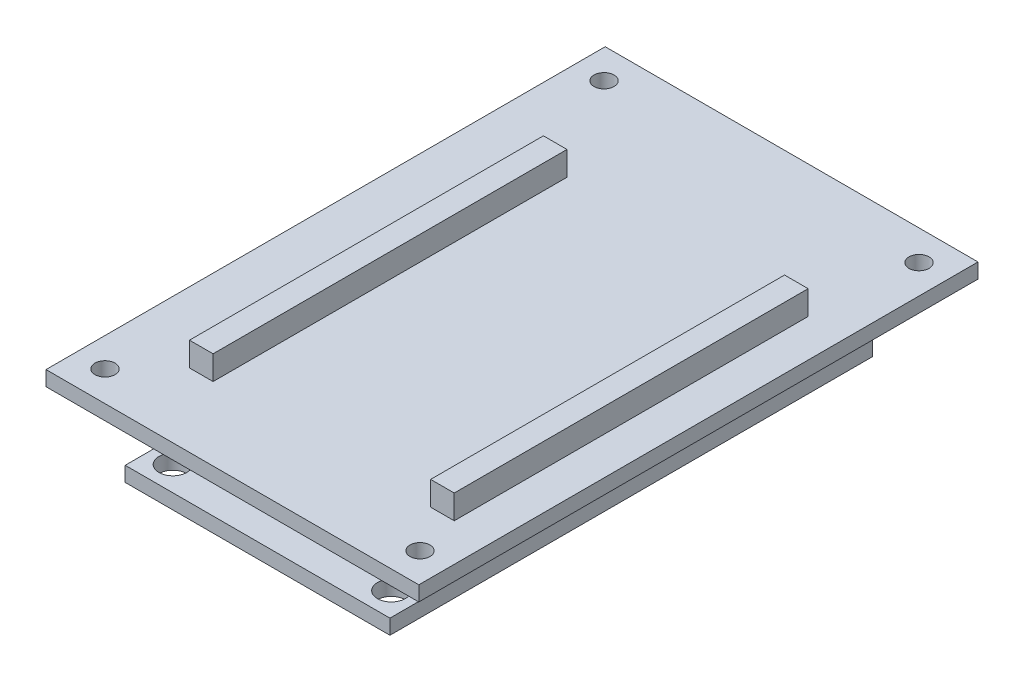
ISO-10303-21;
HEADER;
FILE_DESCRIPTION(('STEP AP214'),'2;1');
FILE_NAME('part.step','',(''),(''),'','','');
FILE_SCHEMA(('AUTOMOTIVE_DESIGN { 1 0 10303 214 1 1 1 1 }'));
ENDSEC;
DATA;
#1=APPLICATION_CONTEXT('core data for automotive mechanical design processes');
#2=APPLICATION_PROTOCOL_DEFINITION('international standard','automotive_design',2000,#1);
#3=PRODUCT_CONTEXT('',#1,'mechanical');
#4=PRODUCT('Part','Part','',(#3));
#5=PRODUCT_RELATED_PRODUCT_CATEGORY('part','',(#4));
#6=PRODUCT_DEFINITION_FORMATION('','',#4);
#7=PRODUCT_DEFINITION_CONTEXT('part definition',#1,'design');
#8=PRODUCT_DEFINITION('design','',#6,#7);
#9=PRODUCT_DEFINITION_SHAPE('','',#8);
#10=(LENGTH_UNIT() NAMED_UNIT(*) SI_UNIT(.MILLI.,.METRE.));
#11=(NAMED_UNIT(*) PLANE_ANGLE_UNIT() SI_UNIT($,.RADIAN.));
#12=(NAMED_UNIT(*) SI_UNIT($,.STERADIAN.) SOLID_ANGLE_UNIT());
#13=UNCERTAINTY_MEASURE_WITH_UNIT(LENGTH_MEASURE(1.E-05),#10,'distance_accuracy_value','');
#14=(GEOMETRIC_REPRESENTATION_CONTEXT(3) GLOBAL_UNCERTAINTY_ASSIGNED_CONTEXT((#13)) GLOBAL_UNIT_ASSIGNED_CONTEXT((#10,
#11,#12)) REPRESENTATION_CONTEXT('',''));
#15=CARTESIAN_POINT('',(0.,0.,0.));
#16=DIRECTION('',(0.,0.,1.));
#17=DIRECTION('',(1.,0.,0.));
#18=AXIS2_PLACEMENT_3D('',#15,#16,#17);
#19=CARTESIAN_POINT('',(-14.2494,1.6002,-25.9715));
#20=DIRECTION('',(1.,0.,0.));
#21=DIRECTION('',(0.,0.,-1.));
#22=AXIS2_PLACEMENT_3D('',#19,#20,#21);
#23=PLANE('',#22);
#24=DIRECTION('',(0.,0.,1.));
#25=VECTOR('',#24,1.);
#26=CARTESIAN_POINT('',(-14.2494,5.6134,-25.9715));
#27=LINE('',#26,#25);
#28=CARTESIAN_POINT('',(-14.2494,5.6134,-19.05));
#29=VERTEX_POINT('',#28);
#30=CARTESIAN_POINT('',(-14.2494,5.6134,19.05));
#31=VERTEX_POINT('',#30);
#32=EDGE_CURVE('E287',#29,#31,#27,.T.);
#33=ORIENTED_EDGE('',*,*,#32,.F.);
#34=DIRECTION('',(0.,-1.,0.));
#35=VECTOR('',#34,1.);
#36=CARTESIAN_POINT('',(-14.2494,9.8044,-19.05));
#37=LINE('',#36,#35);
#38=CARTESIAN_POINT('',(-14.2494,1.6002,-19.05));
#39=VERTEX_POINT('',#38);
#40=EDGE_CURVE('E427',#29,#39,#37,.T.);
#41=ORIENTED_EDGE('',*,*,#40,.T.);
#42=DIRECTION('',(0.,0.,1.));
#43=VECTOR('',#42,1.);
#44=CARTESIAN_POINT('',(-14.2494,1.6002,-25.9715));
#45=LINE('',#44,#43);
#46=CARTESIAN_POINT('',(-14.2494,1.6002,-25.9715));
#47=VERTEX_POINT('',#46);
#48=EDGE_CURVE('E490',#47,#39,#45,.T.);
#49=ORIENTED_EDGE('',*,*,#48,.F.);
#50=DIRECTION('',(0.,-1.,0.));
#51=VECTOR('',#50,1.);
#52=CARTESIAN_POINT('',(-14.2494,1.6002,-25.9715));
#53=LINE('',#52,#51);
#54=CARTESIAN_POINT('',(-14.2494,0.,-25.9715));
#55=VERTEX_POINT('',#54);
#56=EDGE_CURVE('E506',#47,#55,#53,.T.);
#57=ORIENTED_EDGE('',*,*,#56,.T.);
#58=DIRECTION('',(0.,0.,1.));
#59=VECTOR('',#58,1.);
#60=CARTESIAN_POINT('',(-14.2494,0.,-25.9715));
#61=LINE('',#60,#59);
#62=CARTESIAN_POINT('',(-14.2494,0.,25.9715));
#63=VERTEX_POINT('',#62);
#64=EDGE_CURVE('E486',#55,#63,#61,.T.);
#65=ORIENTED_EDGE('',*,*,#64,.T.);
#66=DIRECTION('',(0.,-1.,0.));
#67=VECTOR('',#66,1.);
#68=CARTESIAN_POINT('',(-14.2494,1.6002,25.9715));
#69=LINE('',#68,#67);
#70=CARTESIAN_POINT('',(-14.2494,1.6002,25.9715));
#71=VERTEX_POINT('',#70);
#72=EDGE_CURVE('E530',#71,#63,#69,.T.);
#73=ORIENTED_EDGE('',*,*,#72,.F.);
#74=CARTESIAN_POINT('',(-14.2494,1.6002,19.05));
#75=VERTEX_POINT('',#74);
#76=EDGE_CURVE('E495',#75,#71,#45,.T.);
#77=ORIENTED_EDGE('',*,*,#76,.F.);
#78=DIRECTION('',(0.,-1.,0.));
#79=VECTOR('',#78,1.);
#80=CARTESIAN_POINT('',(-14.2494,9.8044,19.05));
#81=LINE('',#80,#79);
#82=EDGE_CURVE('E452',#31,#75,#81,.T.);
#83=ORIENTED_EDGE('',*,*,#82,.F.);
#84=EDGE_LOOP('',(#33,#41,#49,#57,#65,#73,#77,#83));
#85=FACE_BOUND('',#84,.T.);
#86=ADVANCED_FACE('F45',(#85),#23,.F.);
#87=CARTESIAN_POINT('',(14.2494,1.6002,-25.9715));
#88=DIRECTION('',(-1.,0.,0.));
#89=DIRECTION('',(0.,0.,1.));
#90=AXIS2_PLACEMENT_3D('',#87,#88,#89);
#91=PLANE('',#90);
#92=DIRECTION('',(0.,0.,-1.));
#93=VECTOR('',#92,1.);
#94=CARTESIAN_POINT('',(14.2494,5.6134,-25.9715));
#95=LINE('',#94,#93);
#96=CARTESIAN_POINT('',(14.2494,5.6134,19.05));
#97=VERTEX_POINT('',#96);
#98=CARTESIAN_POINT('',(14.2494,5.6134,-19.05));
#99=VERTEX_POINT('',#98);
#100=EDGE_CURVE('E275',#97,#99,#95,.T.);
#101=ORIENTED_EDGE('',*,*,#100,.F.);
#102=DIRECTION('',(0.,-1.,0.));
#103=VECTOR('',#102,1.);
#104=CARTESIAN_POINT('',(14.2494,9.8044,19.05));
#105=LINE('',#104,#103);
#106=CARTESIAN_POINT('',(14.2494,1.6002,19.05));
#107=VERTEX_POINT('',#106);
#108=EDGE_CURVE('E382',#97,#107,#105,.T.);
#109=ORIENTED_EDGE('',*,*,#108,.T.);
#110=DIRECTION('',(0.,0.,-1.));
#111=VECTOR('',#110,1.);
#112=CARTESIAN_POINT('',(14.2494,1.6002,-25.9715));
#113=LINE('',#112,#111);
#114=CARTESIAN_POINT('',(14.2494,1.6002,25.9715));
#115=VERTEX_POINT('',#114);
#116=EDGE_CURVE('E499',#115,#107,#113,.T.);
#117=ORIENTED_EDGE('',*,*,#116,.F.);
#118=DIRECTION('',(0.,-1.,0.));
#119=VECTOR('',#118,1.);
#120=CARTESIAN_POINT('',(14.2494,1.6002,25.9715));
#121=LINE('',#120,#119);
#122=CARTESIAN_POINT('',(14.2494,0.,25.9715));
#123=VERTEX_POINT('',#122);
#124=EDGE_CURVE('E526',#115,#123,#121,.T.);
#125=ORIENTED_EDGE('',*,*,#124,.T.);
#126=DIRECTION('',(0.,0.,-1.));
#127=VECTOR('',#126,1.);
#128=CARTESIAN_POINT('',(14.2494,0.,-25.9715));
#129=LINE('',#128,#127);
#130=CARTESIAN_POINT('',(14.2494,0.,-25.9715));
#131=VERTEX_POINT('',#130);
#132=EDGE_CURVE('E513',#123,#131,#129,.T.);
#133=ORIENTED_EDGE('',*,*,#132,.T.);
#134=DIRECTION('',(0.,-1.,0.));
#135=VECTOR('',#134,1.);
#136=CARTESIAN_POINT('',(14.2494,1.6002,-25.9715));
#137=LINE('',#136,#135);
#138=CARTESIAN_POINT('',(14.2494,1.6002,-25.9715));
#139=VERTEX_POINT('',#138);
#140=EDGE_CURVE('E522',#139,#131,#137,.T.);
#141=ORIENTED_EDGE('',*,*,#140,.F.);
#142=CARTESIAN_POINT('',(14.2494,1.6002,-19.05));
#143=VERTEX_POINT('',#142);
#144=EDGE_CURVE('E498',#143,#139,#113,.T.);
#145=ORIENTED_EDGE('',*,*,#144,.F.);
#146=DIRECTION('',(0.,-1.,0.));
#147=VECTOR('',#146,1.);
#148=CARTESIAN_POINT('',(14.2494,9.8044,-19.05));
#149=LINE('',#148,#147);
#150=EDGE_CURVE('E407',#99,#143,#149,.T.);
#151=ORIENTED_EDGE('',*,*,#150,.F.);
#152=EDGE_LOOP('',(#101,#109,#117,#125,#133,#141,#145,#151));
#153=FACE_BOUND('',#152,.T.);
#154=ADVANCED_FACE('F552',(#153),#91,.F.);
#155=CARTESIAN_POINT('',(-14.2494,9.8044,19.05));
#156=DIRECTION('',(0.,0.,-1.));
#157=DIRECTION('',(-1.,0.,0.));
#158=AXIS2_PLACEMENT_3D('',#155,#156,#157);
#159=PLANE('',#158);
#160=DIRECTION('',(1.,0.,0.));
#161=VECTOR('',#160,1.);
#162=CARTESIAN_POINT('',(-14.2494,5.6134,19.05));
#163=LINE('',#162,#161);
#164=CARTESIAN_POINT('',(-11.7094,5.6134,19.05));
#165=VERTEX_POINT('',#164);
#166=EDGE_CURVE('E61',#31,#165,#163,.T.);
#167=ORIENTED_EDGE('',*,*,#166,.F.);
#168=ORIENTED_EDGE('',*,*,#82,.T.);
#169=DIRECTION('',(1.,0.,0.));
#170=VECTOR('',#169,1.);
#171=CARTESIAN_POINT('',(-14.2494,1.6002,19.05));
#172=LINE('',#171,#170);
#173=CARTESIAN_POINT('',(-11.7094,1.6002,19.05));
#174=VERTEX_POINT('',#173);
#175=EDGE_CURVE('E412',#75,#174,#172,.T.);
#176=ORIENTED_EDGE('',*,*,#175,.T.);
#177=DIRECTION('',(0.,-1.,0.));
#178=VECTOR('',#177,1.);
#179=CARTESIAN_POINT('',(-11.7094,9.8044,19.05));
#180=LINE('',#179,#178);
#181=EDGE_CURVE('E447',#165,#174,#180,.T.);
#182=ORIENTED_EDGE('',*,*,#181,.F.);
#183=EDGE_LOOP('',(#167,#168,#176,#182));
#184=FACE_BOUND('',#183,.T.);
#185=ADVANCED_FACE('F593',(#184),#159,.F.);
#186=CARTESIAN_POINT('',(-11.7094,9.8044,19.05));
#187=DIRECTION('',(-1.,0.,0.));
#188=DIRECTION('',(0.,0.,1.));
#189=AXIS2_PLACEMENT_3D('',#186,#187,#188);
#190=PLANE('',#189);
#191=DIRECTION('',(0.,0.,-1.));
#192=VECTOR('',#191,1.);
#193=CARTESIAN_POINT('',(-11.7094,5.6134,19.05));
#194=LINE('',#193,#192);
#195=CARTESIAN_POINT('',(-11.7094,5.6134,-19.05));
#196=VERTEX_POINT('',#195);
#197=EDGE_CURVE('E69',#165,#196,#194,.T.);
#198=ORIENTED_EDGE('',*,*,#197,.F.);
#199=ORIENTED_EDGE('',*,*,#181,.T.);
#200=DIRECTION('',(0.,0.,-1.));
#201=VECTOR('',#200,1.);
#202=CARTESIAN_POINT('',(-11.7094,1.6002,19.05));
#203=LINE('',#202,#201);
#204=CARTESIAN_POINT('',(-11.7094,1.6002,-19.05));
#205=VERTEX_POINT('',#204);
#206=EDGE_CURVE('E431',#174,#205,#203,.T.);
#207=ORIENTED_EDGE('',*,*,#206,.T.);
#208=DIRECTION('',(0.,-1.,0.));
#209=VECTOR('',#208,1.);
#210=CARTESIAN_POINT('',(-11.7094,9.8044,-19.05));
#211=LINE('',#210,#209);
#212=EDGE_CURVE('E442',#196,#205,#211,.T.);
#213=ORIENTED_EDGE('',*,*,#212,.F.);
#214=EDGE_LOOP('',(#198,#199,#207,#213));
#215=FACE_BOUND('',#214,.T.);
#216=ADVANCED_FACE('F592',(#215),#190,.F.);
#217=CARTESIAN_POINT('',(-14.2494,9.8044,-19.05));
#218=DIRECTION('',(0.,0.,1.));
#219=DIRECTION('',(1.,0.,0.));
#220=AXIS2_PLACEMENT_3D('',#217,#218,#219);
#221=PLANE('',#220);
#222=DIRECTION('',(-1.,0.,0.));
#223=VECTOR('',#222,1.);
#224=CARTESIAN_POINT('',(-14.2494,5.6134,-19.05));
#225=LINE('',#224,#223);
#226=EDGE_CURVE('E279',#196,#29,#225,.T.);
#227=ORIENTED_EDGE('',*,*,#226,.F.);
#228=ORIENTED_EDGE('',*,*,#212,.T.);
#229=DIRECTION('',(-1.,0.,0.));
#230=VECTOR('',#229,1.);
#231=CARTESIAN_POINT('',(-14.2494,1.6002,-19.05));
#232=LINE('',#231,#230);
#233=EDGE_CURVE('E418',#205,#39,#232,.T.);
#234=ORIENTED_EDGE('',*,*,#233,.T.);
#235=ORIENTED_EDGE('',*,*,#40,.F.);
#236=EDGE_LOOP('',(#227,#228,#234,#235));
#237=FACE_BOUND('',#236,.T.);
#238=ADVANCED_FACE('F580',(#237),#221,.F.);
#239=CARTESIAN_POINT('',(14.2494,9.8044,-19.05));
#240=DIRECTION('',(0.,0.,1.));
#241=DIRECTION('',(1.,0.,0.));
#242=AXIS2_PLACEMENT_3D('',#239,#240,#241);
#243=PLANE('',#242);
#244=DIRECTION('',(-1.,0.,0.));
#245=VECTOR('',#244,1.);
#246=CARTESIAN_POINT('',(14.2494,5.6134,-19.05));
#247=LINE('',#246,#245);
#248=CARTESIAN_POINT('',(11.7094,5.6134,-19.05));
#249=VERTEX_POINT('',#248);
#250=EDGE_CURVE('E266',#99,#249,#247,.T.);
#251=ORIENTED_EDGE('',*,*,#250,.F.);
#252=ORIENTED_EDGE('',*,*,#150,.T.);
#253=DIRECTION('',(-1.,0.,0.));
#254=VECTOR('',#253,1.);
#255=CARTESIAN_POINT('',(14.2494,1.6002,-19.05));
#256=LINE('',#255,#254);
#257=CARTESIAN_POINT('',(11.7094,1.6002,-19.05));
#258=VERTEX_POINT('',#257);
#259=EDGE_CURVE('E333',#143,#258,#256,.T.);
#260=ORIENTED_EDGE('',*,*,#259,.T.);
#261=DIRECTION('',(0.,-1.,0.));
#262=VECTOR('',#261,1.);
#263=CARTESIAN_POINT('',(11.7094,9.8044,-19.05));
#264=LINE('',#263,#262);
#265=EDGE_CURVE('E402',#249,#258,#264,.T.);
#266=ORIENTED_EDGE('',*,*,#265,.F.);
#267=EDGE_LOOP('',(#251,#252,#260,#266));
#268=FACE_BOUND('',#267,.T.);
#269=ADVANCED_FACE('F587',(#268),#243,.F.);
#270=CARTESIAN_POINT('',(11.7094,9.8044,19.05));
#271=DIRECTION('',(1.,0.,0.));
#272=DIRECTION('',(0.,0.,-1.));
#273=AXIS2_PLACEMENT_3D('',#270,#271,#272);
#274=PLANE('',#273);
#275=DIRECTION('',(0.,0.,1.));
#276=VECTOR('',#275,1.);
#277=CARTESIAN_POINT('',(11.7094,5.6134,19.05));
#278=LINE('',#277,#276);
#279=CARTESIAN_POINT('',(11.7094,5.6134,19.05));
#280=VERTEX_POINT('',#279);
#281=EDGE_CURVE('E261',#249,#280,#278,.T.);
#282=ORIENTED_EDGE('',*,*,#281,.F.);
#283=ORIENTED_EDGE('',*,*,#265,.T.);
#284=DIRECTION('',(0.,0.,1.));
#285=VECTOR('',#284,1.);
#286=CARTESIAN_POINT('',(11.7094,1.6002,19.05));
#287=LINE('',#286,#285);
#288=CARTESIAN_POINT('',(11.7094,1.6002,19.05));
#289=VERTEX_POINT('',#288);
#290=EDGE_CURVE('E386',#258,#289,#287,.T.);
#291=ORIENTED_EDGE('',*,*,#290,.T.);
#292=DIRECTION('',(0.,-1.,0.));
#293=VECTOR('',#292,1.);
#294=CARTESIAN_POINT('',(11.7094,9.8044,19.05));
#295=LINE('',#294,#293);
#296=EDGE_CURVE('E397',#280,#289,#295,.T.);
#297=ORIENTED_EDGE('',*,*,#296,.F.);
#298=EDGE_LOOP('',(#282,#283,#291,#297));
#299=FACE_BOUND('',#298,.T.);
#300=ADVANCED_FACE('F544',(#299),#274,.F.);
#301=CARTESIAN_POINT('',(14.2494,9.8044,19.05));
#302=DIRECTION('',(0.,0.,-1.));
#303=DIRECTION('',(-1.,0.,0.));
#304=AXIS2_PLACEMENT_3D('',#301,#302,#303);
#305=PLANE('',#304);
#306=DIRECTION('',(1.,0.,0.));
#307=VECTOR('',#306,1.);
#308=CARTESIAN_POINT('',(14.2494,5.6134,19.05));
#309=LINE('',#308,#307);
#310=EDGE_CURVE('E54',#280,#97,#309,.T.);
#311=ORIENTED_EDGE('',*,*,#310,.F.);
#312=ORIENTED_EDGE('',*,*,#296,.T.);
#313=DIRECTION('',(1.,0.,0.));
#314=VECTOR('',#313,1.);
#315=CARTESIAN_POINT('',(14.2494,1.6002,19.05));
#316=LINE('',#315,#314);
#317=EDGE_CURVE('E373',#289,#107,#316,.T.);
#318=ORIENTED_EDGE('',*,*,#317,.T.);
#319=ORIENTED_EDGE('',*,*,#108,.F.);
#320=EDGE_LOOP('',(#311,#312,#318,#319));
#321=FACE_BOUND('',#320,.T.);
#322=ADVANCED_FACE('F541',(#321),#305,.F.);
#323=CARTESIAN_POINT('',(0.,0.,0.));
#324=DIRECTION('',(0.,1.,0.));
#325=DIRECTION('',(0.,0.,1.));
#326=AXIS2_PLACEMENT_3D('',#323,#324,#325);
#327=PLANE('',#326);
#328=CARTESIAN_POINT('',(11.7602,0.,-23.3299));
#329=DIRECTION('',(0.,1.,0.));
#330=DIRECTION('',(0.,0.,1.));
#331=AXIS2_PLACEMENT_3D('',#328,#329,#330);
#332=CIRCLE('',#331,1.4986);
#333=CARTESIAN_POINT('',(11.7602,0.,-21.8313));
#334=VERTEX_POINT('',#333);
#335=EDGE_CURVE('E457',#334,#334,#332,.T.);
#336=ORIENTED_EDGE('',*,*,#335,.T.);
#337=EDGE_LOOP('',(#336));
#338=FACE_BOUND('',#337,.T.);
#339=CARTESIAN_POINT('',(-11.7602,0.,23.3299));
#340=DIRECTION('',(0.,1.,0.));
#341=DIRECTION('',(0.,0.,1.));
#342=AXIS2_PLACEMENT_3D('',#339,#340,#341);
#343=CIRCLE('',#342,1.4986);
#344=CARTESIAN_POINT('',(-11.7602,0.,24.8285));
#345=VERTEX_POINT('',#344);
#346=EDGE_CURVE('E462',#345,#345,#343,.T.);
#347=ORIENTED_EDGE('',*,*,#346,.T.);
#348=EDGE_LOOP('',(#347));
#349=FACE_BOUND('',#348,.T.);
#350=CARTESIAN_POINT('',(11.7602,0.,23.3299));
#351=DIRECTION('',(0.,1.,0.));
#352=DIRECTION('',(0.,0.,1.));
#353=AXIS2_PLACEMENT_3D('',#350,#351,#352);
#354=CIRCLE('',#353,1.4986);
#355=CARTESIAN_POINT('',(11.7602,0.,24.8285));
#356=VERTEX_POINT('',#355);
#357=EDGE_CURVE('E470',#356,#356,#354,.T.);
#358=ORIENTED_EDGE('',*,*,#357,.T.);
#359=EDGE_LOOP('',(#358));
#360=FACE_BOUND('',#359,.T.);
#361=CARTESIAN_POINT('',(-11.7602,0.,-23.3299));
#362=DIRECTION('',(0.,1.,0.));
#363=DIRECTION('',(0.,0.,1.));
#364=AXIS2_PLACEMENT_3D('',#361,#362,#363);
#365=CIRCLE('',#364,1.4986);
#366=CARTESIAN_POINT('',(-11.7602,0.,-21.8313));
#367=VERTEX_POINT('',#366);
#368=EDGE_CURVE('E478',#367,#367,#365,.T.);
#369=ORIENTED_EDGE('',*,*,#368,.T.);
#370=EDGE_LOOP('',(#369));
#371=FACE_BOUND('',#370,.T.);
#372=ORIENTED_EDGE('',*,*,#64,.F.);
#373=DIRECTION('',(-1.,0.,0.));
#374=VECTOR('',#373,1.);
#375=CARTESIAN_POINT('',(-14.2494,0.,-25.9715));
#376=LINE('',#375,#374);
#377=EDGE_CURVE('E516',#131,#55,#376,.T.);
#378=ORIENTED_EDGE('',*,*,#377,.F.);
#379=ORIENTED_EDGE('',*,*,#132,.F.);
#380=DIRECTION('',(1.,0.,0.));
#381=VECTOR('',#380,1.);
#382=CARTESIAN_POINT('',(-14.2494,0.,25.9715));
#383=LINE('',#382,#381);
#384=EDGE_CURVE('E510',#63,#123,#383,.T.);
#385=ORIENTED_EDGE('',*,*,#384,.F.);
#386=EDGE_LOOP('',(#372,#378,#379,#385));
#387=FACE_BOUND('',#386,.T.);
#388=DIRECTION('',(0.,0.,-1.));
#389=VECTOR('',#388,1.);
#390=CARTESIAN_POINT('',(-7.87400000000001,0.,18.3515));
#391=LINE('',#390,#389);
#392=CARTESIAN_POINT('',(-7.87400000000001,0.,18.3515));
#393=VERTEX_POINT('',#392);
#394=CARTESIAN_POINT('',(-7.87400000000001,0.,0.571500000000006));
#395=VERTEX_POINT('',#394);
#396=EDGE_CURVE('E319',#393,#395,#391,.T.);
#397=ORIENTED_EDGE('',*,*,#396,.F.);
#398=DIRECTION('',(-1.,0.,0.));
#399=VECTOR('',#398,1.);
#400=CARTESIAN_POINT('',(-7.87400000000001,0.,18.3515));
#401=LINE('',#400,#399);
#402=CARTESIAN_POINT('',(7.87399999999999,0.,18.3515));
#403=VERTEX_POINT('',#402);
#404=EDGE_CURVE('E345',#403,#393,#401,.T.);
#405=ORIENTED_EDGE('',*,*,#404,.F.);
#406=DIRECTION('',(0.,0.,1.));
#407=VECTOR('',#406,1.);
#408=CARTESIAN_POINT('',(7.87399999999999,0.,18.3515));
#409=LINE('',#408,#407);
#410=CARTESIAN_POINT('',(7.87399999999999,0.,0.571500000000006));
#411=VERTEX_POINT('',#410);
#412=EDGE_CURVE('E341',#411,#403,#409,.T.);
#413=ORIENTED_EDGE('',*,*,#412,.F.);
#414=DIRECTION('',(1.,0.,0.));
#415=VECTOR('',#414,1.);
#416=CARTESIAN_POINT('',(-7.87400000000001,0.,0.571500000000006));
#417=LINE('',#416,#415);
#418=EDGE_CURVE('E337',#395,#411,#417,.T.);
#419=ORIENTED_EDGE('',*,*,#418,.F.);
#420=EDGE_LOOP('',(#397,#405,#413,#419));
#421=FACE_BOUND('',#420,.T.);
#422=ADVANCED_FACE('F568',(#338,#349,#360,#371,#387,#421),#327,.F.);
#423=CARTESIAN_POINT('',(0.,1.6002,0.));
#424=DIRECTION('',(0.,1.,0.));
#425=DIRECTION('',(0.,0.,1.));
#426=AXIS2_PLACEMENT_3D('',#423,#424,#425);
#427=PLANE('',#426);
#428=CARTESIAN_POINT('',(-11.7602,1.6002,23.3299));
#429=DIRECTION('',(0.,1.,0.));
#430=DIRECTION('',(0.,0.,1.));
#431=AXIS2_PLACEMENT_3D('',#428,#429,#430);
#432=CIRCLE('',#431,1.4986);
#433=CARTESIAN_POINT('',(-11.7602,1.6002,24.8285));
#434=VERTEX_POINT('',#433);
#435=EDGE_CURVE('E466',#434,#434,#432,.T.);
#436=ORIENTED_EDGE('',*,*,#435,.F.);
#437=EDGE_LOOP('',(#436));
#438=FACE_BOUND('',#437,.T.);
#439=CARTESIAN_POINT('',(-11.7602,1.6002,-23.3299));
#440=DIRECTION('',(0.,1.,0.));
#441=DIRECTION('',(0.,0.,1.));
#442=AXIS2_PLACEMENT_3D('',#439,#440,#441);
#443=CIRCLE('',#442,1.4986);
#444=CARTESIAN_POINT('',(-11.7602,1.6002,-21.8313));
#445=VERTEX_POINT('',#444);
#446=EDGE_CURVE('E482',#445,#445,#443,.T.);
#447=ORIENTED_EDGE('',*,*,#446,.F.);
#448=EDGE_LOOP('',(#447));
#449=FACE_BOUND('',#448,.T.);
#450=CARTESIAN_POINT('',(11.7602,1.6002,23.3299));
#451=DIRECTION('',(0.,1.,0.));
#452=DIRECTION('',(0.,0.,1.));
#453=AXIS2_PLACEMENT_3D('',#450,#451,#452);
#454=CIRCLE('',#453,1.4986);
#455=CARTESIAN_POINT('',(11.7602,1.6002,24.8285));
#456=VERTEX_POINT('',#455);
#457=EDGE_CURVE('E474',#456,#456,#454,.T.);
#458=ORIENTED_EDGE('',*,*,#457,.F.);
#459=EDGE_LOOP('',(#458));
#460=FACE_BOUND('',#459,.T.);
#461=CARTESIAN_POINT('',(11.7602,1.6002,-23.3299));
#462=DIRECTION('',(0.,1.,0.));
#463=DIRECTION('',(0.,0.,1.));
#464=AXIS2_PLACEMENT_3D('',#461,#462,#463);
#465=CIRCLE('',#464,1.4986);
#466=CARTESIAN_POINT('',(11.7602,1.6002,-21.8313));
#467=VERTEX_POINT('',#466);
#468=EDGE_CURVE('E458',#467,#467,#465,.T.);
#469=ORIENTED_EDGE('',*,*,#468,.F.);
#470=EDGE_LOOP('',(#469));
#471=FACE_BOUND('',#470,.T.);
#472=ORIENTED_EDGE('',*,*,#290,.F.);
#473=ORIENTED_EDGE('',*,*,#259,.F.);
#474=ORIENTED_EDGE('',*,*,#144,.T.);
#475=DIRECTION('',(-1.,0.,0.));
#476=VECTOR('',#475,1.);
#477=CARTESIAN_POINT('',(-14.2494,1.6002,-25.9715));
#478=LINE('',#477,#476);
#479=EDGE_CURVE('E503',#139,#47,#478,.T.);
#480=ORIENTED_EDGE('',*,*,#479,.T.);
#481=ORIENTED_EDGE('',*,*,#48,.T.);
#482=ORIENTED_EDGE('',*,*,#233,.F.);
#483=ORIENTED_EDGE('',*,*,#206,.F.);
#484=ORIENTED_EDGE('',*,*,#175,.F.);
#485=ORIENTED_EDGE('',*,*,#76,.T.);
#486=DIRECTION('',(1.,0.,0.));
#487=VECTOR('',#486,1.);
#488=CARTESIAN_POINT('',(-14.2494,1.6002,25.9715));
#489=LINE('',#488,#487);
#490=EDGE_CURVE('E494',#71,#115,#489,.T.);
#491=ORIENTED_EDGE('',*,*,#490,.T.);
#492=ORIENTED_EDGE('',*,*,#116,.T.);
#493=ORIENTED_EDGE('',*,*,#317,.F.);
#494=EDGE_LOOP('',(#472,#473,#474,#480,#481,#482,#483,#484,#485,#491,#492,#493));
#495=FACE_BOUND('',#494,.T.);
#496=ADVANCED_FACE('F555',(#438,#449,#460,#471,#495),#427,.T.);
#497=CARTESIAN_POINT('',(-14.2494,1.6002,25.9715));
#498=DIRECTION('',(0.,0.,-1.));
#499=DIRECTION('',(-1.,0.,0.));
#500=AXIS2_PLACEMENT_3D('',#497,#498,#499);
#501=PLANE('',#500);
#502=ORIENTED_EDGE('',*,*,#384,.T.);
#503=ORIENTED_EDGE('',*,*,#124,.F.);
#504=ORIENTED_EDGE('',*,*,#490,.F.);
#505=ORIENTED_EDGE('',*,*,#72,.T.);
#506=EDGE_LOOP('',(#502,#503,#504,#505));
#507=FACE_BOUND('',#506,.T.);
#508=ADVANCED_FACE('F562',(#507),#501,.F.);
#509=CARTESIAN_POINT('',(-14.2494,1.6002,-25.9715));
#510=DIRECTION('',(0.,0.,1.));
#511=DIRECTION('',(1.,0.,0.));
#512=AXIS2_PLACEMENT_3D('',#509,#510,#511);
#513=PLANE('',#512);
#514=ORIENTED_EDGE('',*,*,#377,.T.);
#515=ORIENTED_EDGE('',*,*,#56,.F.);
#516=ORIENTED_EDGE('',*,*,#479,.F.);
#517=ORIENTED_EDGE('',*,*,#140,.T.);
#518=EDGE_LOOP('',(#514,#515,#516,#517));
#519=FACE_BOUND('',#518,.T.);
#520=ADVANCED_FACE('F572',(#519),#513,.F.);
#521=CARTESIAN_POINT('',(-11.7602,1.6002,-23.3299));
#522=DIRECTION('',(0.,-1.,0.));
#523=DIRECTION('',(0.,0.,-1.));
#524=AXIS2_PLACEMENT_3D('',#521,#522,#523);
#525=CYLINDRICAL_SURFACE('',#524,1.4986);
#526=ORIENTED_EDGE('',*,*,#446,.T.);
#527=EDGE_LOOP('',(#526));
#528=FACE_BOUND('',#527,.T.);
#529=ORIENTED_EDGE('',*,*,#368,.F.);
#530=EDGE_LOOP('',(#529));
#531=FACE_BOUND('',#530,.T.);
#532=ADVANCED_FACE('F661',(#528,#531),#525,.F.);
#533=CARTESIAN_POINT('',(11.7602,1.6002,23.3299));
#534=DIRECTION('',(0.,-1.,0.));
#535=DIRECTION('',(0.,0.,-1.));
#536=AXIS2_PLACEMENT_3D('',#533,#534,#535);
#537=CYLINDRICAL_SURFACE('',#536,1.4986);
#538=ORIENTED_EDGE('',*,*,#457,.T.);
#539=EDGE_LOOP('',(#538));
#540=FACE_BOUND('',#539,.T.);
#541=ORIENTED_EDGE('',*,*,#357,.F.);
#542=EDGE_LOOP('',(#541));
#543=FACE_BOUND('',#542,.T.);
#544=ADVANCED_FACE('F657',(#540,#543),#537,.F.);
#545=CARTESIAN_POINT('',(-11.7602,1.6002,23.3299));
#546=DIRECTION('',(0.,-1.,0.));
#547=DIRECTION('',(0.,0.,-1.));
#548=AXIS2_PLACEMENT_3D('',#545,#546,#547);
#549=CYLINDRICAL_SURFACE('',#548,1.4986);
#550=ORIENTED_EDGE('',*,*,#435,.T.);
#551=EDGE_LOOP('',(#550));
#552=FACE_BOUND('',#551,.T.);
#553=ORIENTED_EDGE('',*,*,#346,.F.);
#554=EDGE_LOOP('',(#553));
#555=FACE_BOUND('',#554,.T.);
#556=ADVANCED_FACE('F653',(#552,#555),#549,.F.);
#557=CARTESIAN_POINT('',(11.7602,1.6002,-23.3299));
#558=DIRECTION('',(0.,-1.,0.));
#559=DIRECTION('',(0.,0.,-1.));
#560=AXIS2_PLACEMENT_3D('',#557,#558,#559);
#561=CYLINDRICAL_SURFACE('',#560,1.4986);
#562=ORIENTED_EDGE('',*,*,#468,.T.);
#563=EDGE_LOOP('',(#562));
#564=FACE_BOUND('',#563,.T.);
#565=ORIENTED_EDGE('',*,*,#335,.F.);
#566=EDGE_LOOP('',(#565));
#567=FACE_BOUND('',#566,.T.);
#568=ADVANCED_FACE('F649',(#564,#567),#561,.F.);
#569=CARTESIAN_POINT('',(-7.87400000000001,-31.8031768864039,18.3515));
#570=DIRECTION('',(0.,0.,-1.));
#571=DIRECTION('',(-1.,0.,0.));
#572=AXIS2_PLACEMENT_3D('',#569,#570,#571);
#573=PLANE('',#572);
#574=DIRECTION('',(0.,1.,0.));
#575=VECTOR('',#574,1.);
#576=CARTESIAN_POINT('',(-7.87400000000001,-31.8031768864039,18.3515));
#577=LINE('',#576,#575);
#578=CARTESIAN_POINT('',(-7.87400000000001,-3.2258,18.3515));
#579=VERTEX_POINT('',#578);
#580=EDGE_CURVE('E349',#579,#393,#577,.T.);
#581=ORIENTED_EDGE('',*,*,#580,.F.);
#582=DIRECTION('',(1.,0.,0.));
#583=VECTOR('',#582,1.);
#584=CARTESIAN_POINT('',(-7.87400000000001,-3.2258,18.3515));
#585=LINE('',#584,#583);
#586=CARTESIAN_POINT('',(7.87399999999999,-3.2258,18.3515));
#587=VERTEX_POINT('',#586);
#588=EDGE_CURVE('E325',#579,#587,#585,.T.);
#589=ORIENTED_EDGE('',*,*,#588,.T.);
#590=DIRECTION('',(0.,1.,0.));
#591=VECTOR('',#590,1.);
#592=CARTESIAN_POINT('',(7.87399999999999,-31.8031768864039,18.3515));
#593=LINE('',#592,#591);
#594=EDGE_CURVE('E353',#587,#403,#593,.T.);
#595=ORIENTED_EDGE('',*,*,#594,.T.);
#596=ORIENTED_EDGE('',*,*,#404,.T.);
#597=EDGE_LOOP('',(#581,#589,#595,#596));
#598=FACE_BOUND('',#597,.T.);
#599=ADVANCED_FACE('F652',(#598),#573,.F.);
#600=CARTESIAN_POINT('',(7.87399999999999,-31.8031768864039,18.3515));
#601=DIRECTION('',(-1.,0.,0.));
#602=DIRECTION('',(0.,0.,1.));
#603=AXIS2_PLACEMENT_3D('',#600,#601,#602);
#604=PLANE('',#603);
#605=ORIENTED_EDGE('',*,*,#594,.F.);
#606=DIRECTION('',(0.,0.,-1.));
#607=VECTOR('',#606,1.);
#608=CARTESIAN_POINT('',(7.87399999999999,-3.2258,18.3515));
#609=LINE('',#608,#607);
#610=CARTESIAN_POINT('',(7.87399999999999,-3.2258,0.571500000000006));
#611=VERTEX_POINT('',#610);
#612=EDGE_CURVE('E320',#587,#611,#609,.T.);
#613=ORIENTED_EDGE('',*,*,#612,.T.);
#614=DIRECTION('',(0.,1.,0.));
#615=VECTOR('',#614,1.);
#616=CARTESIAN_POINT('',(7.87399999999999,-31.8031768864039,0.571500000000006));
#617=LINE('',#616,#615);
#618=EDGE_CURVE('E357',#611,#411,#617,.T.);
#619=ORIENTED_EDGE('',*,*,#618,.T.);
#620=ORIENTED_EDGE('',*,*,#412,.T.);
#621=EDGE_LOOP('',(#605,#613,#619,#620));
#622=FACE_BOUND('',#621,.T.);
#623=ADVANCED_FACE('F704',(#622),#604,.F.);
#624=CARTESIAN_POINT('',(-7.87400000000001,-31.8031768864039,0.571500000000006));
#625=DIRECTION('',(0.,0.,1.));
#626=DIRECTION('',(1.,0.,0.));
#627=AXIS2_PLACEMENT_3D('',#624,#625,#626);
#628=PLANE('',#627);
#629=ORIENTED_EDGE('',*,*,#618,.F.);
#630=DIRECTION('',(-1.,0.,0.));
#631=VECTOR('',#630,1.);
#632=CARTESIAN_POINT('',(-7.87400000000001,-3.2258,0.571500000000006));
#633=LINE('',#632,#631);
#634=CARTESIAN_POINT('',(-7.87400000000001,-3.2258,0.571500000000006));
#635=VERTEX_POINT('',#634);
#636=EDGE_CURVE('E324',#611,#635,#633,.T.);
#637=ORIENTED_EDGE('',*,*,#636,.T.);
#638=DIRECTION('',(0.,1.,0.));
#639=VECTOR('',#638,1.);
#640=CARTESIAN_POINT('',(-7.87400000000001,-31.8031768864039,0.571500000000006));
#641=LINE('',#640,#639);
#642=EDGE_CURVE('E361',#635,#395,#641,.T.);
#643=ORIENTED_EDGE('',*,*,#642,.T.);
#644=ORIENTED_EDGE('',*,*,#418,.T.);
#645=EDGE_LOOP('',(#629,#637,#643,#644));
#646=FACE_BOUND('',#645,.T.);
#647=ADVANCED_FACE('F713',(#646),#628,.F.);
#648=CARTESIAN_POINT('',(-7.87400000000001,-31.8031768864039,18.3515));
#649=DIRECTION('',(1.,0.,0.));
#650=DIRECTION('',(0.,0.,-1.));
#651=AXIS2_PLACEMENT_3D('',#648,#649,#650);
#652=PLANE('',#651);
#653=ORIENTED_EDGE('',*,*,#642,.F.);
#654=DIRECTION('',(0.,0.,1.));
#655=VECTOR('',#654,1.);
#656=CARTESIAN_POINT('',(-7.87400000000001,-3.2258,18.3515));
#657=LINE('',#656,#655);
#658=EDGE_CURVE('E329',#635,#579,#657,.T.);
#659=ORIENTED_EDGE('',*,*,#658,.T.);
#660=ORIENTED_EDGE('',*,*,#580,.T.);
#661=ORIENTED_EDGE('',*,*,#396,.T.);
#662=EDGE_LOOP('',(#653,#659,#660,#661));
#663=FACE_BOUND('',#662,.T.);
#664=ADVANCED_FACE('F721',(#663),#652,.F.);
#665=CARTESIAN_POINT('',(0.,-3.2258,0.));
#666=DIRECTION('',(0.,1.,0.));
#667=DIRECTION('',(0.,0.,1.));
#668=AXIS2_PLACEMENT_3D('',#665,#666,#667);
#669=PLANE('',#668);
#670=ORIENTED_EDGE('',*,*,#636,.F.);
#671=ORIENTED_EDGE('',*,*,#612,.F.);
#672=ORIENTED_EDGE('',*,*,#588,.F.);
#673=ORIENTED_EDGE('',*,*,#658,.F.);
#674=EDGE_LOOP('',(#670,#671,#672,#673));
#675=FACE_BOUND('',#674,.T.);
#676=ADVANCED_FACE('F602',(#675),#669,.F.);
#677=CARTESIAN_POINT('',(0.,7.2136,0.));
#678=DIRECTION('',(0.,1.,0.));
#679=DIRECTION('',(0.,0.,1.));
#680=AXIS2_PLACEMENT_3D('',#677,#678,#679);
#681=PLANE('',#680);
#682=DIRECTION('',(0.,0.,-1.));
#683=VECTOR('',#682,1.);
#684=CARTESIAN_POINT('',(14.2494,7.2136,-25.9715));
#685=LINE('',#684,#683);
#686=CARTESIAN_POINT('',(14.2494,7.2136,19.05));
#687=VERTEX_POINT('',#686);
#688=CARTESIAN_POINT('',(14.2494,7.2136,-19.05));
#689=VERTEX_POINT('',#688);
#690=EDGE_CURVE('E299',#687,#689,#685,.T.);
#691=ORIENTED_EDGE('',*,*,#690,.F.);
#692=DIRECTION('',(1.,0.,0.));
#693=VECTOR('',#692,1.);
#694=CARTESIAN_POINT('',(14.2494,7.2136,19.05));
#695=LINE('',#694,#693);
#696=CARTESIAN_POINT('',(11.7094,7.2136,19.05));
#697=VERTEX_POINT('',#696);
#698=EDGE_CURVE('E12',#697,#687,#695,.T.);
#699=ORIENTED_EDGE('',*,*,#698,.F.);
#700=DIRECTION('',(0.,0.,1.));
#701=VECTOR('',#700,1.);
#702=CARTESIAN_POINT('',(11.7094,7.2136,19.05));
#703=LINE('',#702,#701);
#704=CARTESIAN_POINT('',(11.7094,7.2136,-19.05));
#705=VERTEX_POINT('',#704);
#706=EDGE_CURVE('E291',#705,#697,#703,.T.);
#707=ORIENTED_EDGE('',*,*,#706,.F.);
#708=DIRECTION('',(-1.,0.,0.));
#709=VECTOR('',#708,1.);
#710=CARTESIAN_POINT('',(14.2494,7.2136,-19.05));
#711=LINE('',#710,#709);
#712=EDGE_CURVE('E295',#689,#705,#711,.T.);
#713=ORIENTED_EDGE('',*,*,#712,.F.);
#714=EDGE_LOOP('',(#691,#699,#707,#713));
#715=FACE_BOUND('',#714,.T.);
#716=CARTESIAN_POINT('',(15.1980763007742,7.2136,23.6855));
#717=DIRECTION('',(0.,1.,0.));
#718=DIRECTION('',(0.,0.,1.));
#719=AXIS2_PLACEMENT_3D('',#716,#717,#718);
#720=CIRCLE('',#719,1.0795);
#721=CARTESIAN_POINT('',(15.1980763007742,7.2136,24.765));
#722=VERTEX_POINT('',#721);
#723=EDGE_CURVE('E998',#722,#722,#720,.T.);
#724=ORIENTED_EDGE('',*,*,#723,.F.);
#725=EDGE_LOOP('',(#724));
#726=FACE_BOUND('',#725,.T.);
#727=CARTESIAN_POINT('',(-18.7109236992258,7.2136,-30.0355));
#728=DIRECTION('',(0.,1.,0.));
#729=DIRECTION('',(0.,0.,1.));
#730=AXIS2_PLACEMENT_3D('',#727,#728,#729);
#731=CIRCLE('',#730,1.0795);
#732=CARTESIAN_POINT('',(-18.7109236992258,7.2136,-28.956));
#733=VERTEX_POINT('',#732);
#734=EDGE_CURVE('E1001',#733,#733,#731,.T.);
#735=ORIENTED_EDGE('',*,*,#734,.F.);
#736=EDGE_LOOP('',(#735));
#737=FACE_BOUND('',#736,.T.);
#738=DIRECTION('',(0.,0.,1.));
#739=VECTOR('',#738,1.);
#740=CARTESIAN_POINT('',(-21.8224236992258,7.2136,-33.274));
#741=LINE('',#740,#739);
#742=CARTESIAN_POINT('',(-21.8224236992258,7.2136,-33.274));
#743=VERTEX_POINT('',#742);
#744=CARTESIAN_POINT('',(-21.8224236992258,7.2136,26.924));
#745=VERTEX_POINT('',#744);
#746=EDGE_CURVE('E244',#743,#745,#741,.T.);
#747=ORIENTED_EDGE('',*,*,#746,.T.);
#748=DIRECTION('',(1.,0.,0.));
#749=VECTOR('',#748,1.);
#750=CARTESIAN_POINT('',(-21.8224236992258,7.2136,26.924));
#751=LINE('',#750,#749);
#752=CARTESIAN_POINT('',(18.3095763007742,7.2136,26.924));
#753=VERTEX_POINT('',#752);
#754=EDGE_CURVE('E232',#745,#753,#751,.T.);
#755=ORIENTED_EDGE('',*,*,#754,.T.);
#756=DIRECTION('',(0.,0.,-1.));
#757=VECTOR('',#756,1.);
#758=CARTESIAN_POINT('',(18.3095763007742,7.2136,-33.274));
#759=LINE('',#758,#757);
#760=CARTESIAN_POINT('',(18.3095763007742,7.2136,-33.274));
#761=VERTEX_POINT('',#760);
#762=EDGE_CURVE('E243',#753,#761,#759,.T.);
#763=ORIENTED_EDGE('',*,*,#762,.T.);
#764=DIRECTION('',(-1.,0.,0.));
#765=VECTOR('',#764,1.);
#766=CARTESIAN_POINT('',(-21.8224236992258,7.2136,-33.274));
#767=LINE('',#766,#765);
#768=EDGE_CURVE('E250',#761,#743,#767,.T.);
#769=ORIENTED_EDGE('',*,*,#768,.T.);
#770=EDGE_LOOP('',(#747,#755,#763,#769));
#771=FACE_BOUND('',#770,.T.);
#772=CARTESIAN_POINT('',(15.1980763007742,7.2136,-30.0355));
#773=DIRECTION('',(0.,1.,0.));
#774=DIRECTION('',(0.,0.,1.));
#775=AXIS2_PLACEMENT_3D('',#772,#773,#774);
#776=CIRCLE('',#775,1.0795);
#777=CARTESIAN_POINT('',(15.1980763007742,7.2136,-28.956));
#778=VERTEX_POINT('',#777);
#779=EDGE_CURVE('E1010',#778,#778,#776,.T.);
#780=ORIENTED_EDGE('',*,*,#779,.F.);
#781=EDGE_LOOP('',(#780));
#782=FACE_BOUND('',#781,.T.);
#783=CARTESIAN_POINT('',(-18.7109236992258,7.2136,23.6855));
#784=DIRECTION('',(0.,1.,0.));
#785=DIRECTION('',(0.,0.,1.));
#786=AXIS2_PLACEMENT_3D('',#783,#784,#785);
#787=CIRCLE('',#786,1.0795);
#788=CARTESIAN_POINT('',(-18.7109236992258,7.2136,24.765));
#789=VERTEX_POINT('',#788);
#790=EDGE_CURVE('E1043',#789,#789,#787,.T.);
#791=ORIENTED_EDGE('',*,*,#790,.F.);
#792=EDGE_LOOP('',(#791));
#793=FACE_BOUND('',#792,.T.);
#794=DIRECTION('',(0.,0.,1.));
#795=VECTOR('',#794,1.);
#796=CARTESIAN_POINT('',(-14.2494,7.2136,-25.9715));
#797=LINE('',#796,#795);
#798=CARTESIAN_POINT('',(-14.2494,7.2136,-19.05));
#799=VERTEX_POINT('',#798);
#800=CARTESIAN_POINT('',(-14.2494,7.2136,19.05));
#801=VERTEX_POINT('',#800);
#802=EDGE_CURVE('E315',#799,#801,#797,.T.);
#803=ORIENTED_EDGE('',*,*,#802,.F.);
#804=DIRECTION('',(-1.,0.,0.));
#805=VECTOR('',#804,1.);
#806=CARTESIAN_POINT('',(-14.2494,7.2136,-19.05));
#807=LINE('',#806,#805);
#808=CARTESIAN_POINT('',(-11.7094,7.2136,-19.05));
#809=VERTEX_POINT('',#808);
#810=EDGE_CURVE('E303',#809,#799,#807,.T.);
#811=ORIENTED_EDGE('',*,*,#810,.F.);
#812=DIRECTION('',(0.,0.,-1.));
#813=VECTOR('',#812,1.);
#814=CARTESIAN_POINT('',(-11.7094,7.2136,19.05));
#815=LINE('',#814,#813);
#816=CARTESIAN_POINT('',(-11.7094,7.2136,19.05));
#817=VERTEX_POINT('',#816);
#818=EDGE_CURVE('E307',#817,#809,#815,.T.);
#819=ORIENTED_EDGE('',*,*,#818,.F.);
#820=DIRECTION('',(1.,0.,0.));
#821=VECTOR('',#820,1.);
#822=CARTESIAN_POINT('',(-14.2494,7.2136,19.05));
#823=LINE('',#822,#821);
#824=EDGE_CURVE('E311',#801,#817,#823,.T.);
#825=ORIENTED_EDGE('',*,*,#824,.F.);
#826=EDGE_LOOP('',(#803,#811,#819,#825));
#827=FACE_BOUND('',#826,.T.);
#828=ADVANCED_FACE('F247',(#715,#726,#737,#771,#782,#793,#827),#681,.T.);
#829=CARTESIAN_POINT('',(0.,5.6134,0.));
#830=DIRECTION('',(0.,1.,0.));
#831=DIRECTION('',(0.,0.,1.));
#832=AXIS2_PLACEMENT_3D('',#829,#830,#831);
#833=PLANE('',#832);
#834=DIRECTION('',(0.,0.,1.));
#835=VECTOR('',#834,1.);
#836=CARTESIAN_POINT('',(-21.8224236992258,5.6134,-33.274));
#837=LINE('',#836,#835);
#838=CARTESIAN_POINT('',(-21.8224236992258,5.6134,-33.274));
#839=VERTEX_POINT('',#838);
#840=CARTESIAN_POINT('',(-21.8224236992258,5.6134,26.924));
#841=VERTEX_POINT('',#840);
#842=EDGE_CURVE('E259',#839,#841,#837,.T.);
#843=ORIENTED_EDGE('',*,*,#842,.F.);
#844=DIRECTION('',(-1.,0.,0.));
#845=VECTOR('',#844,1.);
#846=CARTESIAN_POINT('',(-21.8224236992258,5.6134,-33.274));
#847=LINE('',#846,#845);
#848=CARTESIAN_POINT('',(18.3095763007742,5.6134,-33.274));
#849=VERTEX_POINT('',#848);
#850=EDGE_CURVE('E255',#849,#839,#847,.T.);
#851=ORIENTED_EDGE('',*,*,#850,.F.);
#852=DIRECTION('',(0.,0.,-1.));
#853=VECTOR('',#852,1.);
#854=CARTESIAN_POINT('',(18.3095763007742,5.6134,-33.274));
#855=LINE('',#854,#853);
#856=CARTESIAN_POINT('',(18.3095763007742,5.6134,26.924));
#857=VERTEX_POINT('',#856);
#858=EDGE_CURVE('E1023',#857,#849,#855,.T.);
#859=ORIENTED_EDGE('',*,*,#858,.F.);
#860=DIRECTION('',(1.,0.,0.));
#861=VECTOR('',#860,1.);
#862=CARTESIAN_POINT('',(-21.8224236992258,5.6134,26.924));
#863=LINE('',#862,#861);
#864=EDGE_CURVE('E1007',#841,#857,#863,.T.);
#865=ORIENTED_EDGE('',*,*,#864,.F.);
#866=EDGE_LOOP('',(#843,#851,#859,#865));
#867=FACE_BOUND('',#866,.T.);
#868=CARTESIAN_POINT('',(-18.7109236992258,5.6134,-30.0355));
#869=DIRECTION('',(0.,1.,0.));
#870=DIRECTION('',(0.,0.,1.));
#871=AXIS2_PLACEMENT_3D('',#868,#869,#870);
#872=CIRCLE('',#871,1.0795);
#873=CARTESIAN_POINT('',(-18.7109236992258,5.6134,-28.956));
#874=VERTEX_POINT('',#873);
#875=EDGE_CURVE('E1003',#874,#874,#872,.T.);
#876=ORIENTED_EDGE('',*,*,#875,.T.);
#877=EDGE_LOOP('',(#876));
#878=FACE_BOUND('',#877,.T.);
#879=CARTESIAN_POINT('',(15.1980763007742,5.6134,-30.0355));
#880=DIRECTION('',(0.,1.,0.));
#881=DIRECTION('',(0.,0.,1.));
#882=AXIS2_PLACEMENT_3D('',#879,#880,#881);
#883=CIRCLE('',#882,1.0795);
#884=CARTESIAN_POINT('',(15.1980763007742,5.6134,-28.956));
#885=VERTEX_POINT('',#884);
#886=EDGE_CURVE('E1013',#885,#885,#883,.T.);
#887=ORIENTED_EDGE('',*,*,#886,.T.);
#888=EDGE_LOOP('',(#887));
#889=FACE_BOUND('',#888,.T.);
#890=CARTESIAN_POINT('',(15.1980763007742,5.6134,23.6855));
#891=DIRECTION('',(0.,1.,0.));
#892=DIRECTION('',(0.,0.,1.));
#893=AXIS2_PLACEMENT_3D('',#890,#891,#892);
#894=CIRCLE('',#893,1.0795);
#895=CARTESIAN_POINT('',(15.1980763007742,5.6134,24.765));
#896=VERTEX_POINT('',#895);
#897=EDGE_CURVE('E1039',#896,#896,#894,.T.);
#898=ORIENTED_EDGE('',*,*,#897,.T.);
#899=EDGE_LOOP('',(#898));
#900=FACE_BOUND('',#899,.T.);
#901=CARTESIAN_POINT('',(-18.7109236992258,5.6134,23.6855));
#902=DIRECTION('',(0.,1.,0.));
#903=DIRECTION('',(0.,0.,1.));
#904=AXIS2_PLACEMENT_3D('',#901,#902,#903);
#905=CIRCLE('',#904,1.0795);
#906=CARTESIAN_POINT('',(-18.7109236992258,5.6134,24.765));
#907=VERTEX_POINT('',#906);
#908=EDGE_CURVE('E1046',#907,#907,#905,.T.);
#909=ORIENTED_EDGE('',*,*,#908,.T.);
#910=EDGE_LOOP('',(#909));
#911=FACE_BOUND('',#910,.T.);
#912=ORIENTED_EDGE('',*,*,#310,.T.);
#913=ORIENTED_EDGE('',*,*,#100,.T.);
#914=ORIENTED_EDGE('',*,*,#250,.T.);
#915=ORIENTED_EDGE('',*,*,#281,.T.);
#916=EDGE_LOOP('',(#912,#913,#914,#915));
#917=FACE_BOUND('',#916,.T.);
#918=ORIENTED_EDGE('',*,*,#226,.T.);
#919=ORIENTED_EDGE('',*,*,#32,.T.);
#920=ORIENTED_EDGE('',*,*,#166,.T.);
#921=ORIENTED_EDGE('',*,*,#197,.T.);
#922=EDGE_LOOP('',(#918,#919,#920,#921));
#923=FACE_BOUND('',#922,.T.);
#924=ADVANCED_FACE('F536',(#867,#878,#889,#900,#911,#917,#923),#833,.F.);
#925=CARTESIAN_POINT('',(-21.8224236992258,7.2136,-33.274));
#926=DIRECTION('',(1.,0.,0.));
#927=DIRECTION('',(0.,0.,-1.));
#928=AXIS2_PLACEMENT_3D('',#925,#926,#927);
#929=PLANE('',#928);
#930=ORIENTED_EDGE('',*,*,#842,.T.);
#931=DIRECTION('',(0.,-1.,0.));
#932=VECTOR('',#931,1.);
#933=CARTESIAN_POINT('',(-21.8224236992258,7.2136,26.924));
#934=LINE('',#933,#932);
#935=EDGE_CURVE('E236',#745,#841,#934,.T.);
#936=ORIENTED_EDGE('',*,*,#935,.F.);
#937=ORIENTED_EDGE('',*,*,#746,.F.);
#938=DIRECTION('',(0.,-1.,0.));
#939=VECTOR('',#938,1.);
#940=CARTESIAN_POINT('',(-21.8224236992258,7.2136,-33.274));
#941=LINE('',#940,#939);
#942=EDGE_CURVE('E1019',#743,#839,#941,.T.);
#943=ORIENTED_EDGE('',*,*,#942,.T.);
#944=EDGE_LOOP('',(#930,#936,#937,#943));
#945=FACE_BOUND('',#944,.T.);
#946=ADVANCED_FACE('F257',(#945),#929,.F.);
#947=CARTESIAN_POINT('',(-21.8224236992258,7.2136,26.924));
#948=DIRECTION('',(0.,0.,-1.));
#949=DIRECTION('',(-1.,0.,0.));
#950=AXIS2_PLACEMENT_3D('',#947,#948,#949);
#951=PLANE('',#950);
#952=ORIENTED_EDGE('',*,*,#864,.T.);
#953=DIRECTION('',(0.,-1.,0.));
#954=VECTOR('',#953,1.);
#955=CARTESIAN_POINT('',(18.3095763007742,7.2136,26.924));
#956=LINE('',#955,#954);
#957=EDGE_CURVE('E239',#753,#857,#956,.T.);
#958=ORIENTED_EDGE('',*,*,#957,.F.);
#959=ORIENTED_EDGE('',*,*,#754,.F.);
#960=ORIENTED_EDGE('',*,*,#935,.T.);
#961=EDGE_LOOP('',(#952,#958,#959,#960));
#962=FACE_BOUND('',#961,.T.);
#963=ADVANCED_FACE('F234',(#962),#951,.F.);
#964=CARTESIAN_POINT('',(18.3095763007742,7.2136,-33.274));
#965=DIRECTION('',(-1.,0.,0.));
#966=DIRECTION('',(0.,0.,1.));
#967=AXIS2_PLACEMENT_3D('',#964,#965,#966);
#968=PLANE('',#967);
#969=ORIENTED_EDGE('',*,*,#858,.T.);
#970=DIRECTION('',(0.,-1.,0.));
#971=VECTOR('',#970,1.);
#972=CARTESIAN_POINT('',(18.3095763007742,7.2136,-33.274));
#973=LINE('',#972,#971);
#974=EDGE_CURVE('E268',#761,#849,#973,.T.);
#975=ORIENTED_EDGE('',*,*,#974,.F.);
#976=ORIENTED_EDGE('',*,*,#762,.F.);
#977=ORIENTED_EDGE('',*,*,#957,.T.);
#978=EDGE_LOOP('',(#969,#975,#976,#977));
#979=FACE_BOUND('',#978,.T.);
#980=ADVANCED_FACE('F767',(#979),#968,.F.);
#981=CARTESIAN_POINT('',(-21.8224236992258,7.2136,-33.274));
#982=DIRECTION('',(0.,0.,1.));
#983=DIRECTION('',(1.,0.,0.));
#984=AXIS2_PLACEMENT_3D('',#981,#982,#983);
#985=PLANE('',#984);
#986=ORIENTED_EDGE('',*,*,#850,.T.);
#987=ORIENTED_EDGE('',*,*,#942,.F.);
#988=ORIENTED_EDGE('',*,*,#768,.F.);
#989=ORIENTED_EDGE('',*,*,#974,.T.);
#990=EDGE_LOOP('',(#986,#987,#988,#989));
#991=FACE_BOUND('',#990,.T.);
#992=ADVANCED_FACE('F776',(#991),#985,.F.);
#993=CARTESIAN_POINT('',(-18.7109236992258,7.2136,-30.0355));
#994=DIRECTION('',(0.,-1.,0.));
#995=DIRECTION('',(0.,0.,-1.));
#996=AXIS2_PLACEMENT_3D('',#993,#994,#995);
#997=CYLINDRICAL_SURFACE('',#996,1.0795);
#998=ORIENTED_EDGE('',*,*,#734,.T.);
#999=EDGE_LOOP('',(#998));
#1000=FACE_BOUND('',#999,.T.);
#1001=ORIENTED_EDGE('',*,*,#875,.F.);
#1002=EDGE_LOOP('',(#1001));
#1003=FACE_BOUND('',#1002,.T.);
#1004=ADVANCED_FACE('F786',(#1000,#1003),#997,.F.);
#1005=CARTESIAN_POINT('',(15.1980763007742,7.2136,-30.0355));
#1006=DIRECTION('',(0.,-1.,0.));
#1007=DIRECTION('',(0.,0.,-1.));
#1008=AXIS2_PLACEMENT_3D('',#1005,#1006,#1007);
#1009=CYLINDRICAL_SURFACE('',#1008,1.0795);
#1010=ORIENTED_EDGE('',*,*,#779,.T.);
#1011=EDGE_LOOP('',(#1010));
#1012=FACE_BOUND('',#1011,.T.);
#1013=ORIENTED_EDGE('',*,*,#886,.F.);
#1014=EDGE_LOOP('',(#1013));
#1015=FACE_BOUND('',#1014,.T.);
#1016=ADVANCED_FACE('F795',(#1012,#1015),#1009,.F.);
#1017=CARTESIAN_POINT('',(15.1980763007742,7.2136,23.6855));
#1018=DIRECTION('',(0.,-1.,0.));
#1019=DIRECTION('',(0.,0.,-1.));
#1020=AXIS2_PLACEMENT_3D('',#1017,#1018,#1019);
#1021=CYLINDRICAL_SURFACE('',#1020,1.0795);
#1022=ORIENTED_EDGE('',*,*,#723,.T.);
#1023=EDGE_LOOP('',(#1022));
#1024=FACE_BOUND('',#1023,.T.);
#1025=ORIENTED_EDGE('',*,*,#897,.F.);
#1026=EDGE_LOOP('',(#1025));
#1027=FACE_BOUND('',#1026,.T.);
#1028=ADVANCED_FACE('F805',(#1024,#1027),#1021,.F.);
#1029=CARTESIAN_POINT('',(-18.7109236992258,7.2136,23.6855));
#1030=DIRECTION('',(0.,-1.,0.));
#1031=DIRECTION('',(0.,0.,-1.));
#1032=AXIS2_PLACEMENT_3D('',#1029,#1030,#1031);
#1033=CYLINDRICAL_SURFACE('',#1032,1.0795);
#1034=ORIENTED_EDGE('',*,*,#790,.T.);
#1035=EDGE_LOOP('',(#1034));
#1036=FACE_BOUND('',#1035,.T.);
#1037=ORIENTED_EDGE('',*,*,#908,.F.);
#1038=EDGE_LOOP('',(#1037));
#1039=FACE_BOUND('',#1038,.T.);
#1040=ADVANCED_FACE('F815',(#1036,#1039),#1033,.F.);
#1041=CARTESIAN_POINT('',(0.,9.8044,0.));
#1042=DIRECTION('',(0.,1.,0.));
#1043=DIRECTION('',(0.,0.,1.));
#1044=AXIS2_PLACEMENT_3D('',#1041,#1042,#1043);
#1045=PLANE('',#1044);
#1046=DIRECTION('',(0.,0.,-1.));
#1047=VECTOR('',#1046,1.);
#1048=CARTESIAN_POINT('',(14.2494,9.8044,19.05));
#1049=LINE('',#1048,#1047);
#1050=CARTESIAN_POINT('',(14.2494,9.8044,19.05));
#1051=VERTEX_POINT('',#1050);
#1052=CARTESIAN_POINT('',(14.2494,9.8044,-19.05));
#1053=VERTEX_POINT('',#1052);
#1054=EDGE_CURVE('E368',#1051,#1053,#1049,.T.);
#1055=ORIENTED_EDGE('',*,*,#1054,.T.);
#1056=DIRECTION('',(-1.,0.,0.));
#1057=VECTOR('',#1056,1.);
#1058=CARTESIAN_POINT('',(14.2494,9.8044,-19.05));
#1059=LINE('',#1058,#1057);
#1060=CARTESIAN_POINT('',(11.7094,9.8044,-19.05));
#1061=VERTEX_POINT('',#1060);
#1062=EDGE_CURVE('E372',#1053,#1061,#1059,.T.);
#1063=ORIENTED_EDGE('',*,*,#1062,.T.);
#1064=DIRECTION('',(0.,0.,1.));
#1065=VECTOR('',#1064,1.);
#1066=CARTESIAN_POINT('',(11.7094,9.8044,19.05));
#1067=LINE('',#1066,#1065);
#1068=CARTESIAN_POINT('',(11.7094,9.8044,19.05));
#1069=VERTEX_POINT('',#1068);
#1070=EDGE_CURVE('E376',#1061,#1069,#1067,.T.);
#1071=ORIENTED_EDGE('',*,*,#1070,.T.);
#1072=DIRECTION('',(1.,0.,0.));
#1073=VECTOR('',#1072,1.);
#1074=CARTESIAN_POINT('',(14.2494,9.8044,19.05));
#1075=LINE('',#1074,#1073);
#1076=EDGE_CURVE('E379',#1069,#1051,#1075,.T.);
#1077=ORIENTED_EDGE('',*,*,#1076,.T.);
#1078=EDGE_LOOP('',(#1055,#1063,#1071,#1077));
#1079=FACE_BOUND('',#1078,.T.);
#1080=ADVANCED_FACE('F825',(#1079),#1045,.T.);
#1081=EDGE_CURVE('E398',#1069,#697,#295,.T.);
#1082=ORIENTED_EDGE('',*,*,#1081,.T.);
#1083=ORIENTED_EDGE('',*,*,#698,.T.);
#1084=EDGE_CURVE('E393',#1051,#687,#105,.T.);
#1085=ORIENTED_EDGE('',*,*,#1084,.F.);
#1086=ORIENTED_EDGE('',*,*,#1076,.F.);
#1087=EDGE_LOOP('',(#1082,#1083,#1085,#1086));
#1088=FACE_BOUND('',#1087,.T.);
#1089=ADVANCED_FACE('F832',(#1088),#305,.F.);
#1090=EDGE_CURVE('E403',#1061,#705,#264,.T.);
#1091=ORIENTED_EDGE('',*,*,#1090,.T.);
#1092=ORIENTED_EDGE('',*,*,#706,.T.);
#1093=ORIENTED_EDGE('',*,*,#1081,.F.);
#1094=ORIENTED_EDGE('',*,*,#1070,.F.);
#1095=EDGE_LOOP('',(#1091,#1092,#1093,#1094));
#1096=FACE_BOUND('',#1095,.T.);
#1097=ADVANCED_FACE('F837',(#1096),#274,.F.);
#1098=EDGE_CURVE('E408',#1053,#689,#149,.T.);
#1099=ORIENTED_EDGE('',*,*,#1098,.T.);
#1100=ORIENTED_EDGE('',*,*,#712,.T.);
#1101=ORIENTED_EDGE('',*,*,#1090,.F.);
#1102=ORIENTED_EDGE('',*,*,#1062,.F.);
#1103=EDGE_LOOP('',(#1099,#1100,#1101,#1102));
#1104=FACE_BOUND('',#1103,.T.);
#1105=ADVANCED_FACE('F642',(#1104),#243,.F.);
#1106=ORIENTED_EDGE('',*,*,#1084,.T.);
#1107=ORIENTED_EDGE('',*,*,#690,.T.);
#1108=ORIENTED_EDGE('',*,*,#1098,.F.);
#1109=ORIENTED_EDGE('',*,*,#1054,.F.);
#1110=EDGE_LOOP('',(#1106,#1107,#1108,#1109));
#1111=FACE_BOUND('',#1110,.T.);
#1112=ADVANCED_FACE('F612',(#1111),#91,.F.);
#1113=CARTESIAN_POINT('',(0.,9.8044,0.));
#1114=DIRECTION('',(0.,-1.,0.));
#1115=DIRECTION('',(0.,0.,-1.));
#1116=AXIS2_PLACEMENT_3D('',#1113,#1114,#1115);
#1117=PLANE('',#1116);
#1118=DIRECTION('',(0.,0.,1.));
#1119=VECTOR('',#1118,1.);
#1120=CARTESIAN_POINT('',(-14.2494,9.8044,19.05));
#1121=LINE('',#1120,#1119);
#1122=CARTESIAN_POINT('',(-14.2494,9.8044,-19.05));
#1123=VERTEX_POINT('',#1122);
#1124=CARTESIAN_POINT('',(-14.2494,9.8044,19.05));
#1125=VERTEX_POINT('',#1124);
#1126=EDGE_CURVE('E413',#1123,#1125,#1121,.T.);
#1127=ORIENTED_EDGE('',*,*,#1126,.T.);
#1128=DIRECTION('',(1.,0.,0.));
#1129=VECTOR('',#1128,1.);
#1130=CARTESIAN_POINT('',(-14.2494,9.8044,19.05));
#1131=LINE('',#1130,#1129);
#1132=CARTESIAN_POINT('',(-11.7094,9.8044,19.05));
#1133=VERTEX_POINT('',#1132);
#1134=EDGE_CURVE('E417',#1125,#1133,#1131,.T.);
#1135=ORIENTED_EDGE('',*,*,#1134,.T.);
#1136=DIRECTION('',(0.,0.,-1.));
#1137=VECTOR('',#1136,1.);
#1138=CARTESIAN_POINT('',(-11.7094,9.8044,19.05));
#1139=LINE('',#1138,#1137);
#1140=CARTESIAN_POINT('',(-11.7094,9.8044,-19.05));
#1141=VERTEX_POINT('',#1140);
#1142=EDGE_CURVE('E421',#1133,#1141,#1139,.T.);
#1143=ORIENTED_EDGE('',*,*,#1142,.T.);
#1144=DIRECTION('',(-1.,0.,0.));
#1145=VECTOR('',#1144,1.);
#1146=CARTESIAN_POINT('',(-14.2494,9.8044,-19.05));
#1147=LINE('',#1146,#1145);
#1148=EDGE_CURVE('E424',#1141,#1123,#1147,.T.);
#1149=ORIENTED_EDGE('',*,*,#1148,.T.);
#1150=EDGE_LOOP('',(#1127,#1135,#1143,#1149));
#1151=FACE_BOUND('',#1150,.T.);
#1152=ADVANCED_FACE('F634',(#1151),#1117,.F.);
#1153=EDGE_CURVE('E443',#1141,#809,#211,.T.);
#1154=ORIENTED_EDGE('',*,*,#1153,.T.);
#1155=ORIENTED_EDGE('',*,*,#810,.T.);
#1156=EDGE_CURVE('E438',#1123,#799,#37,.T.);
#1157=ORIENTED_EDGE('',*,*,#1156,.F.);
#1158=ORIENTED_EDGE('',*,*,#1148,.F.);
#1159=EDGE_LOOP('',(#1154,#1155,#1157,#1158));
#1160=FACE_BOUND('',#1159,.T.);
#1161=ADVANCED_FACE('F627',(#1160),#221,.F.);
#1162=EDGE_CURVE('E448',#1133,#817,#180,.T.);
#1163=ORIENTED_EDGE('',*,*,#1162,.T.);
#1164=ORIENTED_EDGE('',*,*,#818,.T.);
#1165=ORIENTED_EDGE('',*,*,#1153,.F.);
#1166=ORIENTED_EDGE('',*,*,#1142,.F.);
#1167=EDGE_LOOP('',(#1163,#1164,#1165,#1166));
#1168=FACE_BOUND('',#1167,.T.);
#1169=ADVANCED_FACE('F619',(#1168),#190,.F.);
#1170=EDGE_CURVE('E453',#1125,#801,#81,.T.);
#1171=ORIENTED_EDGE('',*,*,#1170,.T.);
#1172=ORIENTED_EDGE('',*,*,#824,.T.);
#1173=ORIENTED_EDGE('',*,*,#1162,.F.);
#1174=ORIENTED_EDGE('',*,*,#1134,.F.);
#1175=EDGE_LOOP('',(#1171,#1172,#1173,#1174));
#1176=FACE_BOUND('',#1175,.T.);
#1177=ADVANCED_FACE('F614',(#1176),#159,.F.);
#1178=ORIENTED_EDGE('',*,*,#1156,.T.);
#1179=ORIENTED_EDGE('',*,*,#802,.T.);
#1180=ORIENTED_EDGE('',*,*,#1170,.F.);
#1181=ORIENTED_EDGE('',*,*,#1126,.F.);
#1182=EDGE_LOOP('',(#1178,#1179,#1180,#1181));
#1183=FACE_BOUND('',#1182,.T.);
#1184=ADVANCED_FACE('F47',(#1183),#23,.F.);
#1185=CLOSED_SHELL('',(#86,#154,#185,#216,#238,#269,#300,#322,#422,#496,#508,#520,#532,#544,
#556,#568,#599,#623,#647,#664,#676,#828,#924,#946,#963,#980,#992,#1004,#1016,#1028,#1040,#1080,
#1089,#1097,#1105,#1112,#1152,#1161,#1169,#1177,#1184));
#1186=MANIFOLD_SOLID_BREP('B2',#1185);
#1187=ADVANCED_BREP_SHAPE_REPRESENTATION('',(#18,#1186),#14);
#1188=SHAPE_DEFINITION_REPRESENTATION(#9,#1187);
ENDSEC;
END-ISO-10303-21;
